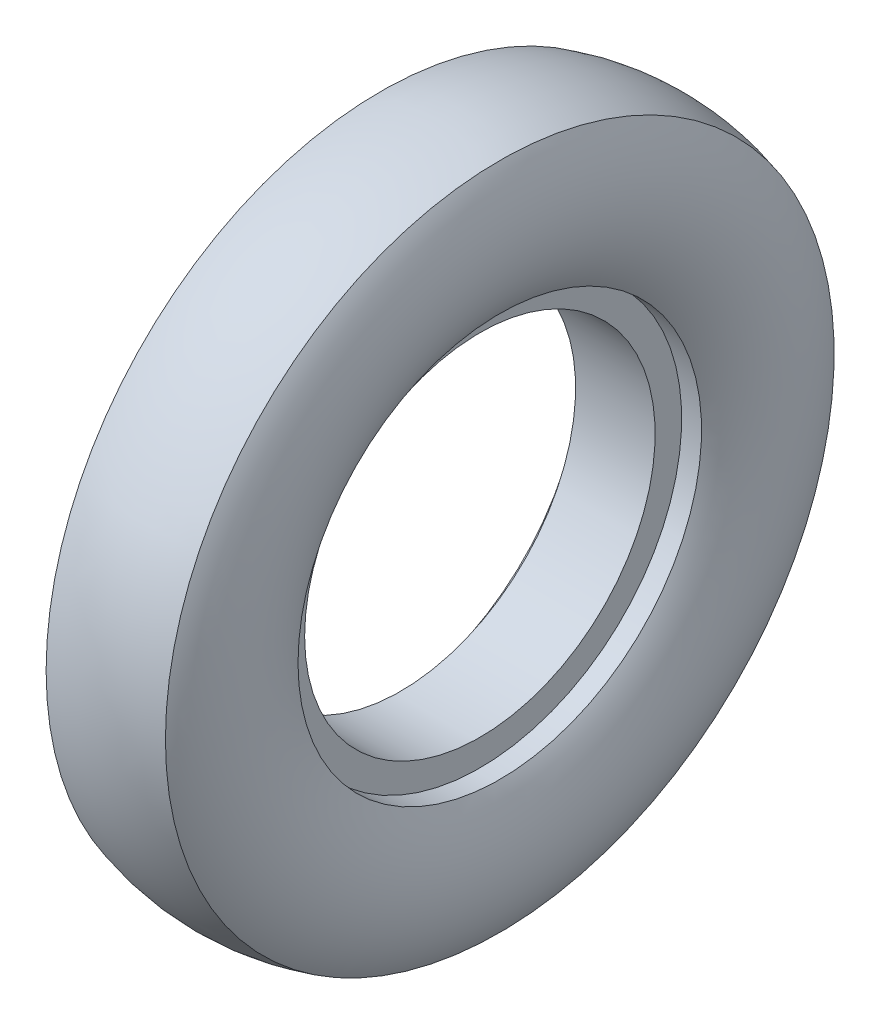
ISO-10303-21;
HEADER;
FILE_DESCRIPTION(('STEP AP214'),'2;1');
FILE_NAME('part.step','',(''),(''),'','','');
FILE_SCHEMA(('AUTOMOTIVE_DESIGN { 1 0 10303 214 1 1 1 1 }'));
ENDSEC;
DATA;
#1=APPLICATION_CONTEXT('core data for automotive mechanical design processes');
#2=APPLICATION_PROTOCOL_DEFINITION('international standard','automotive_design',2000,#1);
#3=PRODUCT_CONTEXT('',#1,'mechanical');
#4=PRODUCT('Part','Part','',(#3));
#5=PRODUCT_RELATED_PRODUCT_CATEGORY('part','',(#4));
#6=PRODUCT_DEFINITION_FORMATION('','',#4);
#7=PRODUCT_DEFINITION_CONTEXT('part definition',#1,'design');
#8=PRODUCT_DEFINITION('design','',#6,#7);
#9=PRODUCT_DEFINITION_SHAPE('','',#8);
#10=(LENGTH_UNIT() NAMED_UNIT(*) SI_UNIT(.MILLI.,.METRE.));
#11=(NAMED_UNIT(*) PLANE_ANGLE_UNIT() SI_UNIT($,.RADIAN.));
#12=(NAMED_UNIT(*) SI_UNIT($,.STERADIAN.) SOLID_ANGLE_UNIT());
#13=UNCERTAINTY_MEASURE_WITH_UNIT(LENGTH_MEASURE(1.E-05),#10,'distance_accuracy_value','');
#14=(GEOMETRIC_REPRESENTATION_CONTEXT(3) GLOBAL_UNCERTAINTY_ASSIGNED_CONTEXT((#13)) GLOBAL_UNIT_ASSIGNED_CONTEXT((#10,
#11,#12)) REPRESENTATION_CONTEXT('',''));
#15=CARTESIAN_POINT('',(0.,0.,0.));
#16=DIRECTION('',(0.,0.,1.));
#17=DIRECTION('',(1.,0.,0.));
#18=AXIS2_PLACEMENT_3D('',#15,#16,#17);
#19=CARTESIAN_POINT('',(2.07650301663033,0.,0.));
#20=DIRECTION('',(-1.,0.,0.));
#21=DIRECTION('',(0.,0.,1.));
#22=AXIS2_PLACEMENT_3D('',#19,#20,#21);
#23=DEGENERATE_TOROIDAL_SURFACE('',#22,10.3029585757771,15.5811697626013,.T.);
#24=CARTESIAN_POINT('',(-2.42349698336967,0.,0.));
#25=DIRECTION('',(-1.,0.,0.));
#26=DIRECTION('',(0.,0.,1.));
#27=AXIS2_PLACEMENT_3D('',#24,#25,#26);
#28=CIRCLE('',#27,25.22015841928);
#29=CARTESIAN_POINT('',(-2.42349698336967,0.,25.22015841928));
#30=VERTEX_POINT('',#29);
#31=EDGE_CURVE('E72',#30,#30,#28,.T.);
#32=ORIENTED_EDGE('',*,*,#31,.F.);
#33=EDGE_LOOP('',(#32));
#34=FACE_BOUND('',#33,.T.);
#35=CARTESIAN_POINT('',(6.57650301663033,0.,0.));
#36=DIRECTION('',(-1.,0.,0.));
#37=DIRECTION('',(0.,0.,1.));
#38=AXIS2_PLACEMENT_3D('',#35,#36,#37);
#39=CIRCLE('',#38,25.22015841928);
#40=CARTESIAN_POINT('',(6.57650301663033,0.,25.22015841928));
#41=VERTEX_POINT('',#40);
#42=EDGE_CURVE('E10',#41,#41,#39,.T.);
#43=ORIENTED_EDGE('',*,*,#42,.T.);
#44=EDGE_LOOP('',(#43));
#45=FACE_BOUND('',#44,.T.);
#46=ADVANCED_FACE('F37',(#34,#45),#23,.T.);
#47=CARTESIAN_POINT('',(-1.006830316703,0.,0.));
#48=DIRECTION('',(-1.,0.,0.));
#49=DIRECTION('',(0.,0.,1.));
#50=AXIS2_PLACEMENT_3D('',#47,#48,#49);
#51=TOROIDAL_SURFACE('',#50,20.22015841928,9.08333333333333);
#52=ORIENTED_EDGE('',*,*,#42,.F.);
#53=EDGE_LOOP('',(#52));
#54=FACE_BOUND('',#53,.T.);
#55=CARTESIAN_POINT('',(6.57650301663033,0.,0.));
#56=DIRECTION('',(-1.,0.,0.));
#57=DIRECTION('',(0.,0.,1.));
#58=AXIS2_PLACEMENT_3D('',#55,#56,#57);
#59=CIRCLE('',#58,15.22015841928);
#60=CARTESIAN_POINT('',(6.57650301663033,0.,15.22015841928));
#61=VERTEX_POINT('',#60);
#62=EDGE_CURVE('E44',#61,#61,#59,.T.);
#63=ORIENTED_EDGE('',*,*,#62,.T.);
#64=EDGE_LOOP('',(#63));
#65=FACE_BOUND('',#64,.T.);
#66=ADVANCED_FACE('F80',(#54,#65),#51,.T.);
#67=CARTESIAN_POINT('',(-18.9075329692576,0.,0.));
#68=DIRECTION('',(-1.,0.,0.));
#69=DIRECTION('',(0.,0.,1.));
#70=AXIS2_PLACEMENT_3D('',#67,#68,#69);
#71=CYLINDRICAL_SURFACE('',#70,15.22015841928);
#72=ORIENTED_EDGE('',*,*,#62,.F.);
#73=EDGE_LOOP('',(#72));
#74=FACE_BOUND('',#73,.T.);
#75=CARTESIAN_POINT('',(5.07650301663033,0.,0.));
#76=DIRECTION('',(-1.,0.,0.));
#77=DIRECTION('',(0.,0.,1.));
#78=AXIS2_PLACEMENT_3D('',#75,#76,#77);
#79=CIRCLE('',#78,15.22015841928);
#80=CARTESIAN_POINT('',(5.07650301663033,0.,15.22015841928));
#81=VERTEX_POINT('',#80);
#82=EDGE_CURVE('E49',#81,#81,#79,.T.);
#83=ORIENTED_EDGE('',*,*,#82,.T.);
#84=EDGE_LOOP('',(#83));
#85=FACE_BOUND('',#84,.T.);
#86=ADVANCED_FACE('F84',(#74,#85),#71,.F.);
#87=CARTESIAN_POINT('',(5.07650301663033,0.,-15.22015841928));
#88=DIRECTION('',(-1.,0.,0.));
#89=DIRECTION('',(0.,0.,1.));
#90=AXIS2_PLACEMENT_3D('',#87,#88,#89);
#91=PLANE('',#90);
#92=ORIENTED_EDGE('',*,*,#82,.F.);
#93=EDGE_LOOP('',(#92));
#94=FACE_BOUND('',#93,.T.);
#95=CARTESIAN_POINT('',(5.07650301663033,0.,0.));
#96=DIRECTION('',(-1.,0.,0.));
#97=DIRECTION('',(0.,0.,1.));
#98=AXIS2_PLACEMENT_3D('',#95,#96,#97);
#99=CIRCLE('',#98,13.22015841928);
#100=CARTESIAN_POINT('',(5.07650301663033,0.,13.22015841928));
#101=VERTEX_POINT('',#100);
#102=EDGE_CURVE('E54',#101,#101,#99,.T.);
#103=ORIENTED_EDGE('',*,*,#102,.T.);
#104=EDGE_LOOP('',(#103));
#105=FACE_BOUND('',#104,.T.);
#106=ADVANCED_FACE('F89',(#94,#105),#91,.F.);
#107=CARTESIAN_POINT('',(-18.9075329692576,0.,0.));
#108=DIRECTION('',(-1.,0.,0.));
#109=DIRECTION('',(0.,0.,1.));
#110=AXIS2_PLACEMENT_3D('',#107,#108,#109);
#111=CYLINDRICAL_SURFACE('',#110,13.22015841928);
#112=ORIENTED_EDGE('',*,*,#102,.F.);
#113=EDGE_LOOP('',(#112));
#114=FACE_BOUND('',#113,.T.);
#115=CARTESIAN_POINT('',(-0.92349698336967,0.,0.));
#116=DIRECTION('',(-1.,0.,0.));
#117=DIRECTION('',(0.,0.,1.));
#118=AXIS2_PLACEMENT_3D('',#115,#116,#117);
#119=CIRCLE('',#118,13.22015841928);
#120=CARTESIAN_POINT('',(-0.92349698336967,0.,13.22015841928));
#121=VERTEX_POINT('',#120);
#122=EDGE_CURVE('E60',#121,#121,#119,.T.);
#123=ORIENTED_EDGE('',*,*,#122,.T.);
#124=EDGE_LOOP('',(#123));
#125=FACE_BOUND('',#124,.T.);
#126=ADVANCED_FACE('F95',(#114,#125),#111,.F.);
#127=CARTESIAN_POINT('',(-0.923496983369669,0.,-15.22015841928));
#128=DIRECTION('',(1.,0.,0.));
#129=DIRECTION('',(0.,0.,-1.));
#130=AXIS2_PLACEMENT_3D('',#127,#128,#129);
#131=PLANE('',#130);
#132=ORIENTED_EDGE('',*,*,#122,.F.);
#133=EDGE_LOOP('',(#132));
#134=FACE_BOUND('',#133,.T.);
#135=CARTESIAN_POINT('',(-0.92349698336967,0.,0.));
#136=DIRECTION('',(-1.,0.,0.));
#137=DIRECTION('',(0.,0.,1.));
#138=AXIS2_PLACEMENT_3D('',#135,#136,#137);
#139=CIRCLE('',#138,15.22015841928);
#140=CARTESIAN_POINT('',(-0.92349698336967,0.,15.22015841928));
#141=VERTEX_POINT('',#140);
#142=EDGE_CURVE('E64',#141,#141,#139,.T.);
#143=ORIENTED_EDGE('',*,*,#142,.T.);
#144=EDGE_LOOP('',(#143));
#145=FACE_BOUND('',#144,.T.);
#146=ADVANCED_FACE('F99',(#134,#145),#131,.F.);
#147=CARTESIAN_POINT('',(-18.9075329692576,0.,0.));
#148=DIRECTION('',(-1.,0.,0.));
#149=DIRECTION('',(0.,0.,1.));
#150=AXIS2_PLACEMENT_3D('',#147,#148,#149);
#151=CYLINDRICAL_SURFACE('',#150,15.22015841928);
#152=ORIENTED_EDGE('',*,*,#142,.F.);
#153=EDGE_LOOP('',(#152));
#154=FACE_BOUND('',#153,.T.);
#155=CARTESIAN_POINT('',(-2.42349698336967,0.,0.));
#156=DIRECTION('',(-1.,0.,0.));
#157=DIRECTION('',(0.,0.,1.));
#158=AXIS2_PLACEMENT_3D('',#155,#156,#157);
#159=CIRCLE('',#158,15.22015841928);
#160=CARTESIAN_POINT('',(-2.42349698336967,0.,15.22015841928));
#161=VERTEX_POINT('',#160);
#162=EDGE_CURVE('E68',#161,#161,#159,.T.);
#163=ORIENTED_EDGE('',*,*,#162,.T.);
#164=EDGE_LOOP('',(#163));
#165=FACE_BOUND('',#164,.T.);
#166=ADVANCED_FACE('F103',(#154,#165),#151,.F.);
#167=CARTESIAN_POINT('',(5.15983634996367,0.,0.));
#168=DIRECTION('',(-1.,0.,0.));
#169=DIRECTION('',(0.,0.,1.));
#170=AXIS2_PLACEMENT_3D('',#167,#168,#169);
#171=TOROIDAL_SURFACE('',#170,20.22015841928,9.08333333333334);
#172=ORIENTED_EDGE('',*,*,#162,.F.);
#173=EDGE_LOOP('',(#172));
#174=FACE_BOUND('',#173,.T.);
#175=ORIENTED_EDGE('',*,*,#31,.T.);
#176=EDGE_LOOP('',(#175));
#177=FACE_BOUND('',#176,.T.);
#178=ADVANCED_FACE('F77',(#174,#177),#171,.T.);
#179=CLOSED_SHELL('',(#46,#66,#86,#106,#126,#146,#166,#178));
#180=MANIFOLD_SOLID_BREP('B2',#179);
#181=ADVANCED_BREP_SHAPE_REPRESENTATION('',(#18,#180),#14);
#182=SHAPE_DEFINITION_REPRESENTATION(#9,#181);
ENDSEC;
END-ISO-10303-21;
